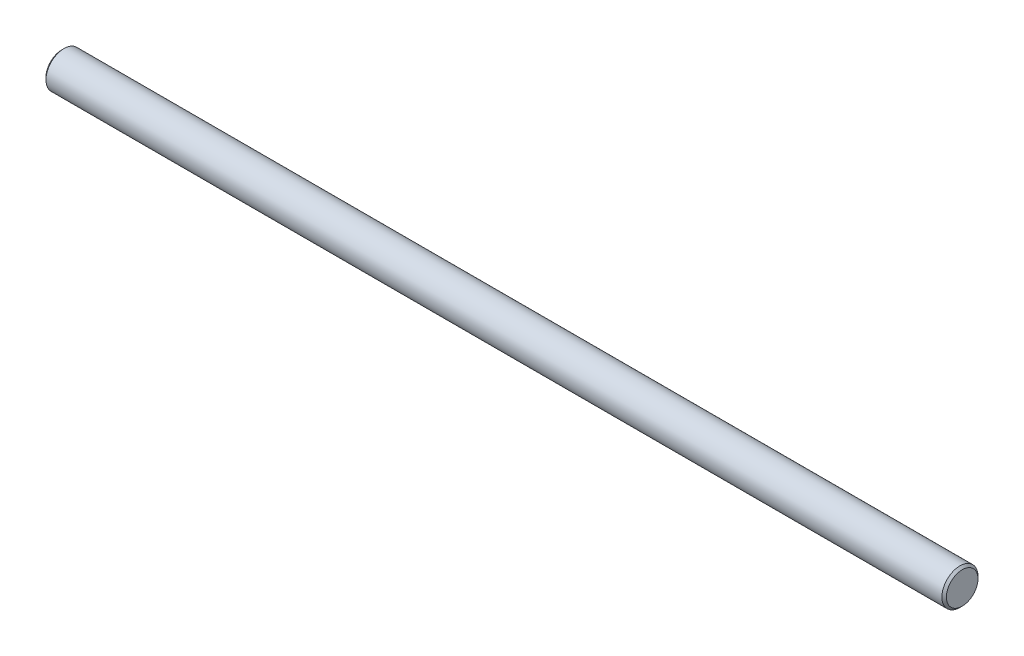
ISO-10303-21;
HEADER;
FILE_DESCRIPTION(('STEP AP214'),'2;1');
FILE_NAME('part.step','',(''),(''),'','','');
FILE_SCHEMA(('AUTOMOTIVE_DESIGN { 1 0 10303 214 1 1 1 1 }'));
ENDSEC;
DATA;
#1=APPLICATION_CONTEXT('core data for automotive mechanical design processes');
#2=APPLICATION_PROTOCOL_DEFINITION('international standard','automotive_design',2000,#1);
#3=PRODUCT_CONTEXT('',#1,'mechanical');
#4=PRODUCT('Part','Part','',(#3));
#5=PRODUCT_RELATED_PRODUCT_CATEGORY('part','',(#4));
#6=PRODUCT_DEFINITION_FORMATION('','',#4);
#7=PRODUCT_DEFINITION_CONTEXT('part definition',#1,'design');
#8=PRODUCT_DEFINITION('design','',#6,#7);
#9=PRODUCT_DEFINITION_SHAPE('','',#8);
#10=(LENGTH_UNIT() NAMED_UNIT(*) SI_UNIT(.MILLI.,.METRE.));
#11=(NAMED_UNIT(*) PLANE_ANGLE_UNIT() SI_UNIT($,.RADIAN.));
#12=(NAMED_UNIT(*) SI_UNIT($,.STERADIAN.) SOLID_ANGLE_UNIT());
#13=UNCERTAINTY_MEASURE_WITH_UNIT(LENGTH_MEASURE(1.E-05),#10,'distance_accuracy_value','');
#14=(GEOMETRIC_REPRESENTATION_CONTEXT(3) GLOBAL_UNCERTAINTY_ASSIGNED_CONTEXT((#13)) GLOBAL_UNIT_ASSIGNED_CONTEXT((#10,
#11,#12)) REPRESENTATION_CONTEXT('',''));
#15=CARTESIAN_POINT('',(0.,0.,0.));
#16=DIRECTION('',(0.,0.,1.));
#17=DIRECTION('',(1.,0.,0.));
#18=AXIS2_PLACEMENT_3D('',#15,#16,#17);
#19=CARTESIAN_POINT('',(199.5,0.,0.));
#20=DIRECTION('',(-1.,0.,0.));
#21=DIRECTION('',(0.,0.,1.));
#22=AXIS2_PLACEMENT_3D('',#19,#20,#21);
#23=CYLINDRICAL_SURFACE('',#22,4.);
#24=CARTESIAN_POINT('',(199.,0.,0.));
#25=DIRECTION('',(1.,0.,0.));
#26=DIRECTION('',(0.,0.,-1.));
#27=AXIS2_PLACEMENT_3D('',#24,#25,#26);
#28=CIRCLE('',#27,4.);
#29=CARTESIAN_POINT('',(199.,0.,-4.));
#30=VERTEX_POINT('',#29);
#31=EDGE_CURVE('E38',#30,#30,#28,.F.);
#32=ORIENTED_EDGE('',*,*,#31,.T.);
#33=EDGE_LOOP('',(#32));
#34=FACE_BOUND('',#33,.T.);
#35=CARTESIAN_POINT('',(0.5,0.,0.));
#36=DIRECTION('',(1.,0.,0.));
#37=DIRECTION('',(0.,0.,-1.));
#38=AXIS2_PLACEMENT_3D('',#35,#36,#37);
#39=CIRCLE('',#38,4.);
#40=CARTESIAN_POINT('',(0.5,0.,-4.));
#41=VERTEX_POINT('',#40);
#42=EDGE_CURVE('E42',#41,#41,#39,.T.);
#43=ORIENTED_EDGE('',*,*,#42,.T.);
#44=EDGE_LOOP('',(#43));
#45=FACE_BOUND('',#44,.T.);
#46=ADVANCED_FACE('F31',(#34,#45),#23,.T.);
#47=CARTESIAN_POINT('',(199.5,0.,0.));
#48=DIRECTION('',(1.,0.,0.));
#49=DIRECTION('',(0.,0.,-1.));
#50=AXIS2_PLACEMENT_3D('',#47,#48,#49);
#51=PLANE('',#50);
#52=CARTESIAN_POINT('',(199.5,0.,0.));
#53=DIRECTION('',(1.,0.,0.));
#54=DIRECTION('',(0.,0.,-1.));
#55=AXIS2_PLACEMENT_3D('',#52,#53,#54);
#56=CIRCLE('',#55,3.5);
#57=CARTESIAN_POINT('',(199.5,0.,-3.5));
#58=VERTEX_POINT('',#57);
#59=EDGE_CURVE('E46',#58,#58,#56,.T.);
#60=ORIENTED_EDGE('',*,*,#59,.T.);
#61=EDGE_LOOP('',(#60));
#62=FACE_BOUND('',#61,.T.);
#63=ADVANCED_FACE('F52',(#62),#51,.T.);
#64=CARTESIAN_POINT('',(0.,0.,0.));
#65=DIRECTION('',(1.,0.,0.));
#66=DIRECTION('',(0.,0.,-1.));
#67=AXIS2_PLACEMENT_3D('',#64,#65,#66);
#68=PLANE('',#67);
#69=CARTESIAN_POINT('',(0.,0.,0.));
#70=DIRECTION('',(1.,0.,0.));
#71=DIRECTION('',(0.,0.,-1.));
#72=AXIS2_PLACEMENT_3D('',#69,#70,#71);
#73=CIRCLE('',#72,3.5);
#74=CARTESIAN_POINT('',(0.,0.,-3.5));
#75=VERTEX_POINT('',#74);
#76=EDGE_CURVE('E10',#75,#75,#73,.F.);
#77=ORIENTED_EDGE('',*,*,#76,.T.);
#78=EDGE_LOOP('',(#77));
#79=FACE_BOUND('',#78,.T.);
#80=ADVANCED_FACE('F56',(#79),#68,.F.);
#81=CARTESIAN_POINT('',(199.5,0.,0.));
#82=DIRECTION('',(-1.,0.,0.));
#83=DIRECTION('',(0.,0.,1.));
#84=AXIS2_PLACEMENT_3D('',#81,#82,#83);
#85=CONICAL_SURFACE('',#84,3.5,0.785398163397473);
#86=ORIENTED_EDGE('',*,*,#31,.F.);
#87=EDGE_LOOP('',(#86));
#88=FACE_BOUND('',#87,.T.);
#89=ORIENTED_EDGE('',*,*,#59,.F.);
#90=EDGE_LOOP('',(#89));
#91=FACE_BOUND('',#90,.T.);
#92=ADVANCED_FACE('F54',(#88,#91),#85,.T.);
#93=CARTESIAN_POINT('',(0.5,0.,0.));
#94=DIRECTION('',(1.,0.,0.));
#95=DIRECTION('',(0.,0.,-1.));
#96=AXIS2_PLACEMENT_3D('',#93,#94,#95);
#97=CONICAL_SURFACE('',#96,4.,0.785398163397445);
#98=ORIENTED_EDGE('',*,*,#76,.F.);
#99=EDGE_LOOP('',(#98));
#100=FACE_BOUND('',#99,.T.);
#101=ORIENTED_EDGE('',*,*,#42,.F.);
#102=EDGE_LOOP('',(#101));
#103=FACE_BOUND('',#102,.T.);
#104=ADVANCED_FACE('F33',(#100,#103),#97,.T.);
#105=CLOSED_SHELL('',(#46,#63,#80,#92,#104));
#106=MANIFOLD_SOLID_BREP('B2',#105);
#107=ADVANCED_BREP_SHAPE_REPRESENTATION('',(#18,#106),#14);
#108=SHAPE_DEFINITION_REPRESENTATION(#9,#107);
ENDSEC;
END-ISO-10303-21;
